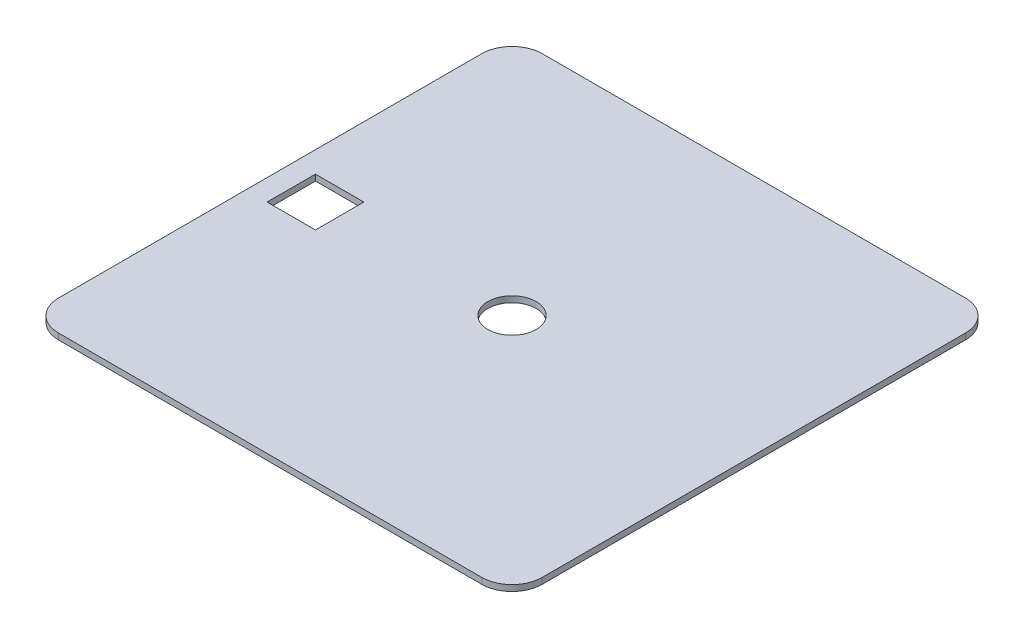
ISO-10303-21;
HEADER;
FILE_DESCRIPTION(('STEP AP214'),'2;1');
FILE_NAME('part.step','',(''),(''),'','','');
FILE_SCHEMA(('AUTOMOTIVE_DESIGN { 1 0 10303 214 1 1 1 1 }'));
ENDSEC;
DATA;
#1=APPLICATION_CONTEXT('core data for automotive mechanical design processes');
#2=APPLICATION_PROTOCOL_DEFINITION('international standard','automotive_design',2000,#1);
#3=PRODUCT_CONTEXT('',#1,'mechanical');
#4=PRODUCT('Part','Part','',(#3));
#5=PRODUCT_RELATED_PRODUCT_CATEGORY('part','',(#4));
#6=PRODUCT_DEFINITION_FORMATION('','',#4);
#7=PRODUCT_DEFINITION_CONTEXT('part definition',#1,'design');
#8=PRODUCT_DEFINITION('design','',#6,#7);
#9=PRODUCT_DEFINITION_SHAPE('','',#8);
#10=(LENGTH_UNIT() NAMED_UNIT(*) SI_UNIT(.MILLI.,.METRE.));
#11=(NAMED_UNIT(*) PLANE_ANGLE_UNIT() SI_UNIT($,.RADIAN.));
#12=(NAMED_UNIT(*) SI_UNIT($,.STERADIAN.) SOLID_ANGLE_UNIT());
#13=UNCERTAINTY_MEASURE_WITH_UNIT(LENGTH_MEASURE(1.E-05),#10,'distance_accuracy_value','');
#14=(GEOMETRIC_REPRESENTATION_CONTEXT(3) GLOBAL_UNCERTAINTY_ASSIGNED_CONTEXT((#13)) GLOBAL_UNIT_ASSIGNED_CONTEXT((#10,
#11,#12)) REPRESENTATION_CONTEXT('',''));
#15=CARTESIAN_POINT('',(0.,0.,0.));
#16=DIRECTION('',(0.,0.,1.));
#17=DIRECTION('',(1.,0.,0.));
#18=AXIS2_PLACEMENT_3D('',#15,#16,#17);
#19=CARTESIAN_POINT('',(0.,1.,0.));
#20=DIRECTION('',(1.,0.,0.));
#21=DIRECTION('',(0.,0.,-1.));
#22=AXIS2_PLACEMENT_3D('',#19,#20,#21);
#23=PLANE('',#22);
#24=DIRECTION('',(0.,0.,1.));
#25=VECTOR('',#24,1.);
#26=CARTESIAN_POINT('',(0.,0.,0.));
#27=LINE('',#26,#25);
#28=CARTESIAN_POINT('',(0.,0.,-75.));
#29=VERTEX_POINT('',#28);
#30=CARTESIAN_POINT('',(0.,0.,-5.));
#31=VERTEX_POINT('',#30);
#32=EDGE_CURVE('E159',#29,#31,#27,.T.);
#33=ORIENTED_EDGE('',*,*,#32,.T.);
#34=DIRECTION('',(0.,-1.,0.));
#35=VECTOR('',#34,1.);
#36=CARTESIAN_POINT('',(0.,1.,-5.));
#37=LINE('',#36,#35);
#38=CARTESIAN_POINT('',(0.,1.,-5.));
#39=VERTEX_POINT('',#38);
#40=EDGE_CURVE('E11',#31,#39,#37,.F.);
#41=ORIENTED_EDGE('',*,*,#40,.T.);
#42=DIRECTION('',(0.,0.,1.));
#43=VECTOR('',#42,1.);
#44=CARTESIAN_POINT('',(0.,1.,0.));
#45=LINE('',#44,#43);
#46=CARTESIAN_POINT('',(0.,1.,-75.));
#47=VERTEX_POINT('',#46);
#48=EDGE_CURVE('E162',#47,#39,#45,.T.);
#49=ORIENTED_EDGE('',*,*,#48,.F.);
#50=DIRECTION('',(0.,-1.,0.));
#51=VECTOR('',#50,1.);
#52=CARTESIAN_POINT('',(0.,1.,-75.));
#53=LINE('',#52,#51);
#54=EDGE_CURVE('E39',#47,#29,#53,.T.);
#55=ORIENTED_EDGE('',*,*,#54,.T.);
#56=EDGE_LOOP('',(#33,#41,#49,#55));
#57=FACE_BOUND('',#56,.T.);
#58=ADVANCED_FACE('F31',(#57),#23,.F.);
#59=CARTESIAN_POINT('',(0.,1.,0.));
#60=DIRECTION('',(0.,0.,-1.));
#61=DIRECTION('',(-1.,0.,0.));
#62=AXIS2_PLACEMENT_3D('',#59,#60,#61);
#63=PLANE('',#62);
#64=DIRECTION('',(1.,0.,0.));
#65=VECTOR('',#64,1.);
#66=CARTESIAN_POINT('',(0.,0.,0.));
#67=LINE('',#66,#65);
#68=CARTESIAN_POINT('',(5.,0.,0.));
#69=VERTEX_POINT('',#68);
#70=CARTESIAN_POINT('',(75.,0.,0.));
#71=VERTEX_POINT('',#70);
#72=EDGE_CURVE('E178',#69,#71,#67,.T.);
#73=ORIENTED_EDGE('',*,*,#72,.T.);
#74=DIRECTION('',(0.,-1.,0.));
#75=VECTOR('',#74,1.);
#76=CARTESIAN_POINT('',(75.,1.,0.));
#77=LINE('',#76,#75);
#78=CARTESIAN_POINT('',(75.,1.,0.));
#79=VERTEX_POINT('',#78);
#80=EDGE_CURVE('E214',#71,#79,#77,.F.);
#81=ORIENTED_EDGE('',*,*,#80,.T.);
#82=DIRECTION('',(1.,0.,0.));
#83=VECTOR('',#82,1.);
#84=CARTESIAN_POINT('',(0.,1.,0.));
#85=LINE('',#84,#83);
#86=CARTESIAN_POINT('',(5.,1.,0.));
#87=VERTEX_POINT('',#86);
#88=EDGE_CURVE('E165',#87,#79,#85,.T.);
#89=ORIENTED_EDGE('',*,*,#88,.F.);
#90=DIRECTION('',(0.,-1.,0.));
#91=VECTOR('',#90,1.);
#92=CARTESIAN_POINT('',(5.,1.,0.));
#93=LINE('',#92,#91);
#94=EDGE_CURVE('E211',#87,#69,#93,.T.);
#95=ORIENTED_EDGE('',*,*,#94,.T.);
#96=EDGE_LOOP('',(#73,#81,#89,#95));
#97=FACE_BOUND('',#96,.T.);
#98=ADVANCED_FACE('F232',(#97),#63,.F.);
#99=CARTESIAN_POINT('',(80.,1.,0.));
#100=DIRECTION('',(-1.,0.,0.));
#101=DIRECTION('',(0.,0.,1.));
#102=AXIS2_PLACEMENT_3D('',#99,#100,#101);
#103=PLANE('',#102);
#104=DIRECTION('',(0.,0.,-1.));
#105=VECTOR('',#104,1.);
#106=CARTESIAN_POINT('',(80.,0.,0.));
#107=LINE('',#106,#105);
#108=CARTESIAN_POINT('',(80.,0.,-5.));
#109=VERTEX_POINT('',#108);
#110=CARTESIAN_POINT('',(80.,0.,-75.));
#111=VERTEX_POINT('',#110);
#112=EDGE_CURVE('E181',#109,#111,#107,.T.);
#113=ORIENTED_EDGE('',*,*,#112,.T.);
#114=DIRECTION('',(0.,-1.,0.));
#115=VECTOR('',#114,1.);
#116=CARTESIAN_POINT('',(80.,1.,-75.));
#117=LINE('',#116,#115);
#118=CARTESIAN_POINT('',(80.,1.,-75.));
#119=VERTEX_POINT('',#118);
#120=EDGE_CURVE('E201',#111,#119,#117,.F.);
#121=ORIENTED_EDGE('',*,*,#120,.T.);
#122=DIRECTION('',(0.,0.,-1.));
#123=VECTOR('',#122,1.);
#124=CARTESIAN_POINT('',(80.,1.,0.));
#125=LINE('',#124,#123);
#126=CARTESIAN_POINT('',(80.,1.,-5.));
#127=VERTEX_POINT('',#126);
#128=EDGE_CURVE('E169',#127,#119,#125,.T.);
#129=ORIENTED_EDGE('',*,*,#128,.F.);
#130=DIRECTION('',(0.,-1.,0.));
#131=VECTOR('',#130,1.);
#132=CARTESIAN_POINT('',(80.,1.,-5.));
#133=LINE('',#132,#131);
#134=EDGE_CURVE('E198',#127,#109,#133,.T.);
#135=ORIENTED_EDGE('',*,*,#134,.T.);
#136=EDGE_LOOP('',(#113,#121,#129,#135));
#137=FACE_BOUND('',#136,.T.);
#138=ADVANCED_FACE('F243',(#137),#103,.F.);
#139=CARTESIAN_POINT('',(0.,1.,-80.));
#140=DIRECTION('',(0.,0.,1.));
#141=DIRECTION('',(1.,0.,0.));
#142=AXIS2_PLACEMENT_3D('',#139,#140,#141);
#143=PLANE('',#142);
#144=DIRECTION('',(-1.,0.,0.));
#145=VECTOR('',#144,1.);
#146=CARTESIAN_POINT('',(0.,1.,-80.));
#147=LINE('',#146,#145);
#148=CARTESIAN_POINT('',(75.,1.,-80.));
#149=VERTEX_POINT('',#148);
#150=CARTESIAN_POINT('',(4.99999999999999,1.,-80.));
#151=VERTEX_POINT('',#150);
#152=EDGE_CURVE('E172',#149,#151,#147,.T.);
#153=ORIENTED_EDGE('',*,*,#152,.F.);
#154=DIRECTION('',(0.,-1.,0.));
#155=VECTOR('',#154,1.);
#156=CARTESIAN_POINT('',(75.,1.,-80.));
#157=LINE('',#156,#155);
#158=CARTESIAN_POINT('',(75.,0.,-80.));
#159=VERTEX_POINT('',#158);
#160=EDGE_CURVE('E187',#149,#159,#157,.T.);
#161=ORIENTED_EDGE('',*,*,#160,.T.);
#162=DIRECTION('',(-1.,0.,0.));
#163=VECTOR('',#162,1.);
#164=CARTESIAN_POINT('',(0.,0.,-80.));
#165=LINE('',#164,#163);
#166=CARTESIAN_POINT('',(4.99999999999999,0.,-80.));
#167=VERTEX_POINT('',#166);
#168=EDGE_CURVE('E166',#159,#167,#165,.T.);
#169=ORIENTED_EDGE('',*,*,#168,.T.);
#170=DIRECTION('',(0.,-1.,0.));
#171=VECTOR('',#170,1.);
#172=CARTESIAN_POINT('',(4.99999999999999,1.,-80.));
#173=LINE('',#172,#171);
#174=EDGE_CURVE('E175',#167,#151,#173,.F.);
#175=ORIENTED_EDGE('',*,*,#174,.T.);
#176=EDGE_LOOP('',(#153,#161,#169,#175));
#177=FACE_BOUND('',#176,.T.);
#178=ADVANCED_FACE('F251',(#177),#143,.F.);
#179=CARTESIAN_POINT('',(0.,1.,-80.));
#180=DIRECTION('',(0.,-1.,0.));
#181=DIRECTION('',(0.,0.,-1.));
#182=AXIS2_PLACEMENT_3D('',#179,#180,#181);
#183=PLANE('',#182);
#184=DIRECTION('',(1.,0.,0.));
#185=VECTOR('',#184,1.);
#186=CARTESIAN_POINT('',(3.49999999999999,1.,-36.));
#187=LINE('',#186,#185);
#188=CARTESIAN_POINT('',(3.49999999999999,1.,-36.));
#189=VERTEX_POINT('',#188);
#190=CARTESIAN_POINT('',(11.5,1.,-36.));
#191=VERTEX_POINT('',#190);
#192=EDGE_CURVE('E146',#189,#191,#187,.T.);
#193=ORIENTED_EDGE('',*,*,#192,.F.);
#194=DIRECTION('',(0.,0.,1.));
#195=VECTOR('',#194,1.);
#196=CARTESIAN_POINT('',(3.49999999999999,1.,-44.));
#197=LINE('',#196,#195);
#198=CARTESIAN_POINT('',(3.49999999999999,1.,-44.));
#199=VERTEX_POINT('',#198);
#200=EDGE_CURVE('E46',#199,#189,#197,.T.);
#201=ORIENTED_EDGE('',*,*,#200,.F.);
#202=DIRECTION('',(-1.,0.,0.));
#203=VECTOR('',#202,1.);
#204=CARTESIAN_POINT('',(3.49999999999999,1.,-44.));
#205=LINE('',#204,#203);
#206=CARTESIAN_POINT('',(11.5,1.,-44.));
#207=VERTEX_POINT('',#206);
#208=EDGE_CURVE('E137',#207,#199,#205,.T.);
#209=ORIENTED_EDGE('',*,*,#208,.F.);
#210=DIRECTION('',(0.,0.,-1.));
#211=VECTOR('',#210,1.);
#212=CARTESIAN_POINT('',(11.5,1.,-44.));
#213=LINE('',#212,#211);
#214=EDGE_CURVE('E140',#191,#207,#213,.T.);
#215=ORIENTED_EDGE('',*,*,#214,.F.);
#216=EDGE_LOOP('',(#193,#201,#209,#215));
#217=FACE_BOUND('',#216,.T.);
#218=CARTESIAN_POINT('',(40.,1.,-40.));
#219=DIRECTION('',(0.,1.,0.));
#220=DIRECTION('',(0.,0.,1.));
#221=AXIS2_PLACEMENT_3D('',#218,#219,#220);
#222=CIRCLE('',#221,4.);
#223=CARTESIAN_POINT('',(40.,1.,-36.));
#224=VERTEX_POINT('',#223);
#225=EDGE_CURVE('E152',#224,#224,#222,.T.);
#226=ORIENTED_EDGE('',*,*,#225,.F.);
#227=EDGE_LOOP('',(#226));
#228=FACE_BOUND('',#227,.T.);
#229=ORIENTED_EDGE('',*,*,#128,.T.);
#230=CARTESIAN_POINT('',(75.,1.,-75.));
#231=DIRECTION('',(0.,-1.,0.));
#232=DIRECTION('',(0.,0.,-1.));
#233=AXIS2_PLACEMENT_3D('',#230,#231,#232);
#234=CIRCLE('',#233,5.);
#235=EDGE_CURVE('E209',#119,#149,#234,.F.);
#236=ORIENTED_EDGE('',*,*,#235,.T.);
#237=ORIENTED_EDGE('',*,*,#152,.T.);
#238=CARTESIAN_POINT('',(4.99999999999999,1.,-75.));
#239=DIRECTION('',(0.,-1.,0.));
#240=DIRECTION('',(0.,0.,-1.));
#241=AXIS2_PLACEMENT_3D('',#238,#239,#240);
#242=CIRCLE('',#241,5.);
#243=EDGE_CURVE('E203',#151,#47,#242,.F.);
#244=ORIENTED_EDGE('',*,*,#243,.T.);
#245=ORIENTED_EDGE('',*,*,#48,.T.);
#246=CARTESIAN_POINT('',(5.,1.,-5.));
#247=DIRECTION('',(0.,-1.,0.));
#248=DIRECTION('',(0.,0.,-1.));
#249=AXIS2_PLACEMENT_3D('',#246,#247,#248);
#250=CIRCLE('',#249,5.);
#251=EDGE_CURVE('E205',#39,#87,#250,.F.);
#252=ORIENTED_EDGE('',*,*,#251,.T.);
#253=ORIENTED_EDGE('',*,*,#88,.T.);
#254=CARTESIAN_POINT('',(75.,1.,-5.));
#255=DIRECTION('',(0.,-1.,0.));
#256=DIRECTION('',(0.,0.,-1.));
#257=AXIS2_PLACEMENT_3D('',#254,#255,#256);
#258=CIRCLE('',#257,5.);
#259=EDGE_CURVE('E207',#79,#127,#258,.F.);
#260=ORIENTED_EDGE('',*,*,#259,.T.);
#261=EDGE_LOOP('',(#229,#236,#237,#244,#245,#252,#253,#260));
#262=FACE_BOUND('',#261,.T.);
#263=ADVANCED_FACE('F236',(#217,#228,#262),#183,.F.);
#264=CARTESIAN_POINT('',(0.,0.,-80.));
#265=DIRECTION('',(0.,-1.,0.));
#266=DIRECTION('',(0.,0.,-1.));
#267=AXIS2_PLACEMENT_3D('',#264,#265,#266);
#268=PLANE('',#267);
#269=DIRECTION('',(0.,0.,1.));
#270=VECTOR('',#269,1.);
#271=CARTESIAN_POINT('',(3.49999999999999,0.,-44.));
#272=LINE('',#271,#270);
#273=CARTESIAN_POINT('',(3.49999999999999,0.,-44.));
#274=VERTEX_POINT('',#273);
#275=CARTESIAN_POINT('',(3.49999999999999,0.,-36.));
#276=VERTEX_POINT('',#275);
#277=EDGE_CURVE('E121',#274,#276,#272,.T.);
#278=ORIENTED_EDGE('',*,*,#277,.T.);
#279=DIRECTION('',(1.,0.,0.));
#280=VECTOR('',#279,1.);
#281=CARTESIAN_POINT('',(3.49999999999999,0.,-36.));
#282=LINE('',#281,#280);
#283=CARTESIAN_POINT('',(11.5,0.,-36.));
#284=VERTEX_POINT('',#283);
#285=EDGE_CURVE('E130',#276,#284,#282,.T.);
#286=ORIENTED_EDGE('',*,*,#285,.T.);
#287=DIRECTION('',(0.,0.,-1.));
#288=VECTOR('',#287,1.);
#289=CARTESIAN_POINT('',(11.5,0.,-44.));
#290=LINE('',#289,#288);
#291=CARTESIAN_POINT('',(11.5,0.,-44.));
#292=VERTEX_POINT('',#291);
#293=EDGE_CURVE('E54',#284,#292,#290,.T.);
#294=ORIENTED_EDGE('',*,*,#293,.T.);
#295=DIRECTION('',(-1.,0.,0.));
#296=VECTOR('',#295,1.);
#297=CARTESIAN_POINT('',(3.49999999999999,0.,-44.));
#298=LINE('',#297,#296);
#299=EDGE_CURVE('E127',#292,#274,#298,.T.);
#300=ORIENTED_EDGE('',*,*,#299,.T.);
#301=EDGE_LOOP('',(#278,#286,#294,#300));
#302=FACE_BOUND('',#301,.T.);
#303=CARTESIAN_POINT('',(40.,0.,-40.));
#304=DIRECTION('',(0.,1.,0.));
#305=DIRECTION('',(0.,0.,1.));
#306=AXIS2_PLACEMENT_3D('',#303,#304,#305);
#307=CIRCLE('',#306,4.);
#308=CARTESIAN_POINT('',(40.,0.,-36.));
#309=VERTEX_POINT('',#308);
#310=EDGE_CURVE('E156',#309,#309,#307,.T.);
#311=ORIENTED_EDGE('',*,*,#310,.T.);
#312=EDGE_LOOP('',(#311));
#313=FACE_BOUND('',#312,.T.);
#314=ORIENTED_EDGE('',*,*,#168,.F.);
#315=CARTESIAN_POINT('',(75.,0.,-75.));
#316=DIRECTION('',(0.,-1.,0.));
#317=DIRECTION('',(0.,0.,-1.));
#318=AXIS2_PLACEMENT_3D('',#315,#316,#317);
#319=CIRCLE('',#318,5.);
#320=EDGE_CURVE('E196',#159,#111,#319,.T.);
#321=ORIENTED_EDGE('',*,*,#320,.T.);
#322=ORIENTED_EDGE('',*,*,#112,.F.);
#323=CARTESIAN_POINT('',(75.,0.,-5.));
#324=DIRECTION('',(0.,-1.,0.));
#325=DIRECTION('',(0.,0.,-1.));
#326=AXIS2_PLACEMENT_3D('',#323,#324,#325);
#327=CIRCLE('',#326,5.);
#328=EDGE_CURVE('E194',#109,#71,#327,.T.);
#329=ORIENTED_EDGE('',*,*,#328,.T.);
#330=ORIENTED_EDGE('',*,*,#72,.F.);
#331=CARTESIAN_POINT('',(5.,0.,-5.));
#332=DIRECTION('',(0.,-1.,0.));
#333=DIRECTION('',(0.,0.,-1.));
#334=AXIS2_PLACEMENT_3D('',#331,#332,#333);
#335=CIRCLE('',#334,5.);
#336=EDGE_CURVE('E192',#69,#31,#335,.T.);
#337=ORIENTED_EDGE('',*,*,#336,.T.);
#338=ORIENTED_EDGE('',*,*,#32,.F.);
#339=CARTESIAN_POINT('',(4.99999999999999,0.,-75.));
#340=DIRECTION('',(0.,-1.,0.));
#341=DIRECTION('',(0.,0.,-1.));
#342=AXIS2_PLACEMENT_3D('',#339,#340,#341);
#343=CIRCLE('',#342,5.);
#344=EDGE_CURVE('E190',#29,#167,#343,.T.);
#345=ORIENTED_EDGE('',*,*,#344,.T.);
#346=EDGE_LOOP('',(#314,#321,#322,#329,#330,#337,#338,#345));
#347=FACE_BOUND('',#346,.T.);
#348=ADVANCED_FACE('F134',(#302,#313,#347),#268,.T.);
#349=CARTESIAN_POINT('',(75.,1.,-75.));
#350=DIRECTION('',(0.,-1.,0.));
#351=DIRECTION('',(0.,0.,-1.));
#352=AXIS2_PLACEMENT_3D('',#349,#350,#351);
#353=CYLINDRICAL_SURFACE('',#352,5.);
#354=ORIENTED_EDGE('',*,*,#235,.F.);
#355=ORIENTED_EDGE('',*,*,#120,.F.);
#356=ORIENTED_EDGE('',*,*,#320,.F.);
#357=ORIENTED_EDGE('',*,*,#160,.F.);
#358=EDGE_LOOP('',(#354,#355,#356,#357));
#359=FACE_BOUND('',#358,.T.);
#360=ADVANCED_FACE('F248',(#359),#353,.T.);
#361=CARTESIAN_POINT('',(75.,1.,-5.));
#362=DIRECTION('',(0.,-1.,0.));
#363=DIRECTION('',(0.,0.,-1.));
#364=AXIS2_PLACEMENT_3D('',#361,#362,#363);
#365=CYLINDRICAL_SURFACE('',#364,5.);
#366=ORIENTED_EDGE('',*,*,#259,.F.);
#367=ORIENTED_EDGE('',*,*,#80,.F.);
#368=ORIENTED_EDGE('',*,*,#328,.F.);
#369=ORIENTED_EDGE('',*,*,#134,.F.);
#370=EDGE_LOOP('',(#366,#367,#368,#369));
#371=FACE_BOUND('',#370,.T.);
#372=ADVANCED_FACE('F240',(#371),#365,.T.);
#373=CARTESIAN_POINT('',(5.,1.,-5.));
#374=DIRECTION('',(0.,-1.,0.));
#375=DIRECTION('',(0.,0.,-1.));
#376=AXIS2_PLACEMENT_3D('',#373,#374,#375);
#377=CYLINDRICAL_SURFACE('',#376,5.);
#378=ORIENTED_EDGE('',*,*,#251,.F.);
#379=ORIENTED_EDGE('',*,*,#40,.F.);
#380=ORIENTED_EDGE('',*,*,#336,.F.);
#381=ORIENTED_EDGE('',*,*,#94,.F.);
#382=EDGE_LOOP('',(#378,#379,#380,#381));
#383=FACE_BOUND('',#382,.T.);
#384=ADVANCED_FACE('F229',(#383),#377,.T.);
#385=CARTESIAN_POINT('',(4.99999999999999,1.,-75.));
#386=DIRECTION('',(0.,-1.,0.));
#387=DIRECTION('',(0.,0.,-1.));
#388=AXIS2_PLACEMENT_3D('',#385,#386,#387);
#389=CYLINDRICAL_SURFACE('',#388,5.);
#390=ORIENTED_EDGE('',*,*,#243,.F.);
#391=ORIENTED_EDGE('',*,*,#174,.F.);
#392=ORIENTED_EDGE('',*,*,#344,.F.);
#393=ORIENTED_EDGE('',*,*,#54,.F.);
#394=EDGE_LOOP('',(#390,#391,#392,#393));
#395=FACE_BOUND('',#394,.T.);
#396=ADVANCED_FACE('F33',(#395),#389,.T.);
#397=CARTESIAN_POINT('',(40.,0.,-40.));
#398=DIRECTION('',(0.,1.,0.));
#399=DIRECTION('',(0.,0.,1.));
#400=AXIS2_PLACEMENT_3D('',#397,#398,#399);
#401=CYLINDRICAL_SURFACE('',#400,4.);
#402=ORIENTED_EDGE('',*,*,#310,.F.);
#403=EDGE_LOOP('',(#402));
#404=FACE_BOUND('',#403,.T.);
#405=ORIENTED_EDGE('',*,*,#225,.T.);
#406=EDGE_LOOP('',(#405));
#407=FACE_BOUND('',#406,.T.);
#408=ADVANCED_FACE('F254',(#404,#407),#401,.F.);
#409=CARTESIAN_POINT('',(3.49999999999999,0.,-44.));
#410=DIRECTION('',(-1.,0.,0.));
#411=DIRECTION('',(0.,0.,1.));
#412=AXIS2_PLACEMENT_3D('',#409,#410,#411);
#413=PLANE('',#412);
#414=ORIENTED_EDGE('',*,*,#200,.T.);
#415=DIRECTION('',(0.,1.,0.));
#416=VECTOR('',#415,1.);
#417=CARTESIAN_POINT('',(3.49999999999999,0.,-36.));
#418=LINE('',#417,#416);
#419=EDGE_CURVE('E117',#276,#189,#418,.T.);
#420=ORIENTED_EDGE('',*,*,#419,.F.);
#421=ORIENTED_EDGE('',*,*,#277,.F.);
#422=DIRECTION('',(0.,1.,0.));
#423=VECTOR('',#422,1.);
#424=CARTESIAN_POINT('',(3.49999999999999,0.,-44.));
#425=LINE('',#424,#423);
#426=EDGE_CURVE('E150',#274,#199,#425,.T.);
#427=ORIENTED_EDGE('',*,*,#426,.T.);
#428=EDGE_LOOP('',(#414,#420,#421,#427));
#429=FACE_BOUND('',#428,.T.);
#430=ADVANCED_FACE('F119',(#429),#413,.F.);
#431=CARTESIAN_POINT('',(3.49999999999999,0.,-44.));
#432=DIRECTION('',(0.,0.,-1.));
#433=DIRECTION('',(-1.,0.,0.));
#434=AXIS2_PLACEMENT_3D('',#431,#432,#433);
#435=PLANE('',#434);
#436=ORIENTED_EDGE('',*,*,#208,.T.);
#437=ORIENTED_EDGE('',*,*,#426,.F.);
#438=ORIENTED_EDGE('',*,*,#299,.F.);
#439=DIRECTION('',(0.,1.,0.));
#440=VECTOR('',#439,1.);
#441=CARTESIAN_POINT('',(11.5,0.,-44.));
#442=LINE('',#441,#440);
#443=EDGE_CURVE('E153',#292,#207,#442,.T.);
#444=ORIENTED_EDGE('',*,*,#443,.T.);
#445=EDGE_LOOP('',(#436,#437,#438,#444));
#446=FACE_BOUND('',#445,.T.);
#447=ADVANCED_FACE('F319',(#446),#435,.F.);
#448=CARTESIAN_POINT('',(11.5,0.,-44.));
#449=DIRECTION('',(1.,0.,0.));
#450=DIRECTION('',(0.,0.,-1.));
#451=AXIS2_PLACEMENT_3D('',#448,#449,#450);
#452=PLANE('',#451);
#453=ORIENTED_EDGE('',*,*,#214,.T.);
#454=ORIENTED_EDGE('',*,*,#443,.F.);
#455=ORIENTED_EDGE('',*,*,#293,.F.);
#456=DIRECTION('',(0.,1.,0.));
#457=VECTOR('',#456,1.);
#458=CARTESIAN_POINT('',(11.5,0.,-36.));
#459=LINE('',#458,#457);
#460=EDGE_CURVE('E126',#284,#191,#459,.T.);
#461=ORIENTED_EDGE('',*,*,#460,.T.);
#462=EDGE_LOOP('',(#453,#454,#455,#461));
#463=FACE_BOUND('',#462,.T.);
#464=ADVANCED_FACE('F328',(#463),#452,.F.);
#465=CARTESIAN_POINT('',(3.49999999999999,0.,-36.));
#466=DIRECTION('',(0.,0.,1.));
#467=DIRECTION('',(1.,0.,0.));
#468=AXIS2_PLACEMENT_3D('',#465,#466,#467);
#469=PLANE('',#468);
#470=ORIENTED_EDGE('',*,*,#192,.T.);
#471=ORIENTED_EDGE('',*,*,#460,.F.);
#472=ORIENTED_EDGE('',*,*,#285,.F.);
#473=ORIENTED_EDGE('',*,*,#419,.T.);
#474=EDGE_LOOP('',(#470,#471,#472,#473));
#475=FACE_BOUND('',#474,.T.);
#476=ADVANCED_FACE('F131',(#475),#469,.F.);
#477=CLOSED_SHELL('',(#58,#98,#138,#178,#263,#348,#360,#372,#384,#396,#408,#430,#447,#464,#476));
#478=MANIFOLD_SOLID_BREP('B2',#477);
#479=ADVANCED_BREP_SHAPE_REPRESENTATION('',(#18,#478),#14);
#480=SHAPE_DEFINITION_REPRESENTATION(#9,#479);
ENDSEC;
END-ISO-10303-21;
